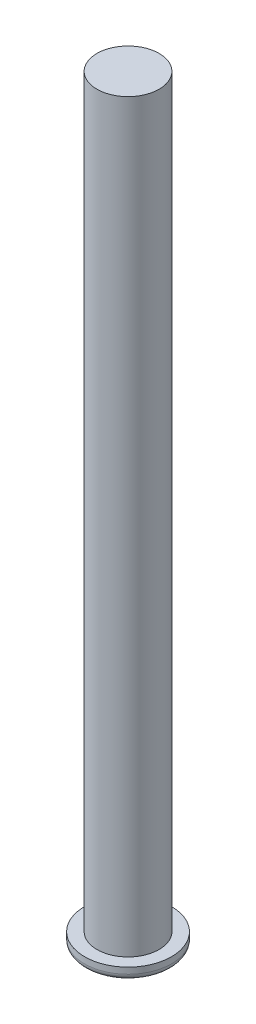
ISO-10303-21;
HEADER;
FILE_DESCRIPTION(('STEP AP214'),'2;1');
FILE_NAME('part.step','',(''),(''),'','','');
FILE_SCHEMA(('AUTOMOTIVE_DESIGN { 1 0 10303 214 1 1 1 1 }'));
ENDSEC;
DATA;
#1=APPLICATION_CONTEXT('core data for automotive mechanical design processes');
#2=APPLICATION_PROTOCOL_DEFINITION('international standard','automotive_design',2000,#1);
#3=PRODUCT_CONTEXT('',#1,'mechanical');
#4=PRODUCT('Part','Part','',(#3));
#5=PRODUCT_RELATED_PRODUCT_CATEGORY('part','',(#4));
#6=PRODUCT_DEFINITION_FORMATION('','',#4);
#7=PRODUCT_DEFINITION_CONTEXT('part definition',#1,'design');
#8=PRODUCT_DEFINITION('design','',#6,#7);
#9=PRODUCT_DEFINITION_SHAPE('','',#8);
#10=(LENGTH_UNIT() NAMED_UNIT(*) SI_UNIT(.MILLI.,.METRE.));
#11=(NAMED_UNIT(*) PLANE_ANGLE_UNIT() SI_UNIT($,.RADIAN.));
#12=(NAMED_UNIT(*) SI_UNIT($,.STERADIAN.) SOLID_ANGLE_UNIT());
#13=UNCERTAINTY_MEASURE_WITH_UNIT(LENGTH_MEASURE(1.E-05),#10,'distance_accuracy_value','');
#14=(GEOMETRIC_REPRESENTATION_CONTEXT(3) GLOBAL_UNCERTAINTY_ASSIGNED_CONTEXT((#13)) GLOBAL_UNIT_ASSIGNED_CONTEXT((#10,
#11,#12)) REPRESENTATION_CONTEXT('',''));
#15=CARTESIAN_POINT('',(0.,0.,0.));
#16=DIRECTION('',(0.,0.,1.));
#17=DIRECTION('',(1.,0.,0.));
#18=AXIS2_PLACEMENT_3D('',#15,#16,#17);
#19=CARTESIAN_POINT('',(0.,120.,0.));
#20=DIRECTION('',(0.,-1.,0.));
#21=DIRECTION('',(0.,0.,-1.));
#22=AXIS2_PLACEMENT_3D('',#19,#20,#21);
#23=CYLINDRICAL_SURFACE('',#22,5.);
#24=CARTESIAN_POINT('',(0.,120.,0.));
#25=DIRECTION('',(0.,1.,0.));
#26=DIRECTION('',(0.,0.,1.));
#27=AXIS2_PLACEMENT_3D('',#24,#25,#26);
#28=CIRCLE('',#27,5.);
#29=CARTESIAN_POINT('',(0.,120.,5.));
#30=VERTEX_POINT('',#29);
#31=EDGE_CURVE('E42',#30,#30,#28,.T.);
#32=ORIENTED_EDGE('',*,*,#31,.F.);
#33=EDGE_LOOP('',(#32));
#34=FACE_BOUND('',#33,.T.);
#35=CARTESIAN_POINT('',(0.,0.,0.));
#36=DIRECTION('',(0.,-1.,0.));
#37=DIRECTION('',(0.,0.,-1.));
#38=AXIS2_PLACEMENT_3D('',#35,#36,#37);
#39=CIRCLE('',#38,5.);
#40=CARTESIAN_POINT('',(0.,0.,-5.));
#41=VERTEX_POINT('',#40);
#42=EDGE_CURVE('E46',#41,#41,#39,.T.);
#43=ORIENTED_EDGE('',*,*,#42,.F.);
#44=EDGE_LOOP('',(#43));
#45=FACE_BOUND('',#44,.T.);
#46=ADVANCED_FACE('F31',(#34,#45),#23,.T.);
#47=CARTESIAN_POINT('',(0.,120.,0.));
#48=DIRECTION('',(0.,1.,0.));
#49=DIRECTION('',(0.,0.,1.));
#50=AXIS2_PLACEMENT_3D('',#47,#48,#49);
#51=PLANE('',#50);
#52=ORIENTED_EDGE('',*,*,#31,.T.);
#53=EDGE_LOOP('',(#52));
#54=FACE_BOUND('',#53,.T.);
#55=ADVANCED_FACE('F70',(#54),#51,.T.);
#56=CARTESIAN_POINT('',(0.,-2.,0.));
#57=DIRECTION('',(0.,1.,0.));
#58=DIRECTION('',(0.,0.,1.));
#59=AXIS2_PLACEMENT_3D('',#56,#57,#58);
#60=CYLINDRICAL_SURFACE('',#59,7.);
#61=CARTESIAN_POINT('',(0.,-1.,0.));
#62=DIRECTION('',(0.,-1.,0.));
#63=DIRECTION('',(0.,0.,-1.));
#64=AXIS2_PLACEMENT_3D('',#61,#62,#63);
#65=CIRCLE('',#64,7.);
#66=CARTESIAN_POINT('',(0.,-1.,-7.));
#67=VERTEX_POINT('',#66);
#68=EDGE_CURVE('E10',#67,#67,#65,.F.);
#69=ORIENTED_EDGE('',*,*,#68,.T.);
#70=EDGE_LOOP('',(#69));
#71=FACE_BOUND('',#70,.T.);
#72=CARTESIAN_POINT('',(0.,0.,0.));
#73=DIRECTION('',(0.,-1.,0.));
#74=DIRECTION('',(0.,0.,-1.));
#75=AXIS2_PLACEMENT_3D('',#72,#73,#74);
#76=CIRCLE('',#75,7.);
#77=CARTESIAN_POINT('',(0.,0.,-7.));
#78=VERTEX_POINT('',#77);
#79=EDGE_CURVE('E51',#78,#78,#76,.T.);
#80=ORIENTED_EDGE('',*,*,#79,.T.);
#81=EDGE_LOOP('',(#80));
#82=FACE_BOUND('',#81,.T.);
#83=ADVANCED_FACE('F55',(#71,#82),#60,.T.);
#84=CARTESIAN_POINT('',(0.,-2.,0.));
#85=DIRECTION('',(0.,-1.,0.));
#86=DIRECTION('',(0.,0.,-1.));
#87=AXIS2_PLACEMENT_3D('',#84,#85,#86);
#88=PLANE('',#87);
#89=CARTESIAN_POINT('',(0.,-2.,0.));
#90=DIRECTION('',(0.,-1.,0.));
#91=DIRECTION('',(0.,0.,-1.));
#92=AXIS2_PLACEMENT_3D('',#89,#90,#91);
#93=CIRCLE('',#92,6.);
#94=CARTESIAN_POINT('',(0.,-2.,-6.));
#95=VERTEX_POINT('',#94);
#96=EDGE_CURVE('E38',#95,#95,#93,.T.);
#97=ORIENTED_EDGE('',*,*,#96,.T.);
#98=EDGE_LOOP('',(#97));
#99=FACE_BOUND('',#98,.T.);
#100=ADVANCED_FACE('F59',(#99),#88,.T.);
#101=CARTESIAN_POINT('',(0.,0.,0.));
#102=DIRECTION('',(0.,-1.,0.));
#103=DIRECTION('',(0.,0.,-1.));
#104=AXIS2_PLACEMENT_3D('',#101,#102,#103);
#105=PLANE('',#104);
#106=ORIENTED_EDGE('',*,*,#42,.T.);
#107=EDGE_LOOP('',(#106));
#108=FACE_BOUND('',#107,.T.);
#109=ORIENTED_EDGE('',*,*,#79,.F.);
#110=EDGE_LOOP('',(#109));
#111=FACE_BOUND('',#110,.T.);
#112=ADVANCED_FACE('F57',(#108,#111),#105,.F.);
#113=CARTESIAN_POINT('',(0.,-1.,0.));
#114=DIRECTION('',(0.,-1.,0.));
#115=DIRECTION('',(0.,0.,-1.));
#116=AXIS2_PLACEMENT_3D('',#113,#114,#115);
#117=TOROIDAL_SURFACE('',#116,6.,1.);
#118=ORIENTED_EDGE('',*,*,#68,.F.);
#119=EDGE_LOOP('',(#118));
#120=FACE_BOUND('',#119,.T.);
#121=ORIENTED_EDGE('',*,*,#96,.F.);
#122=EDGE_LOOP('',(#121));
#123=FACE_BOUND('',#122,.T.);
#124=ADVANCED_FACE('F33',(#120,#123),#117,.T.);
#125=CLOSED_SHELL('',(#46,#55,#83,#100,#112,#124));
#126=MANIFOLD_SOLID_BREP('B2',#125);
#127=ADVANCED_BREP_SHAPE_REPRESENTATION('',(#18,#126),#14);
#128=SHAPE_DEFINITION_REPRESENTATION(#9,#127);
ENDSEC;
END-ISO-10303-21;
